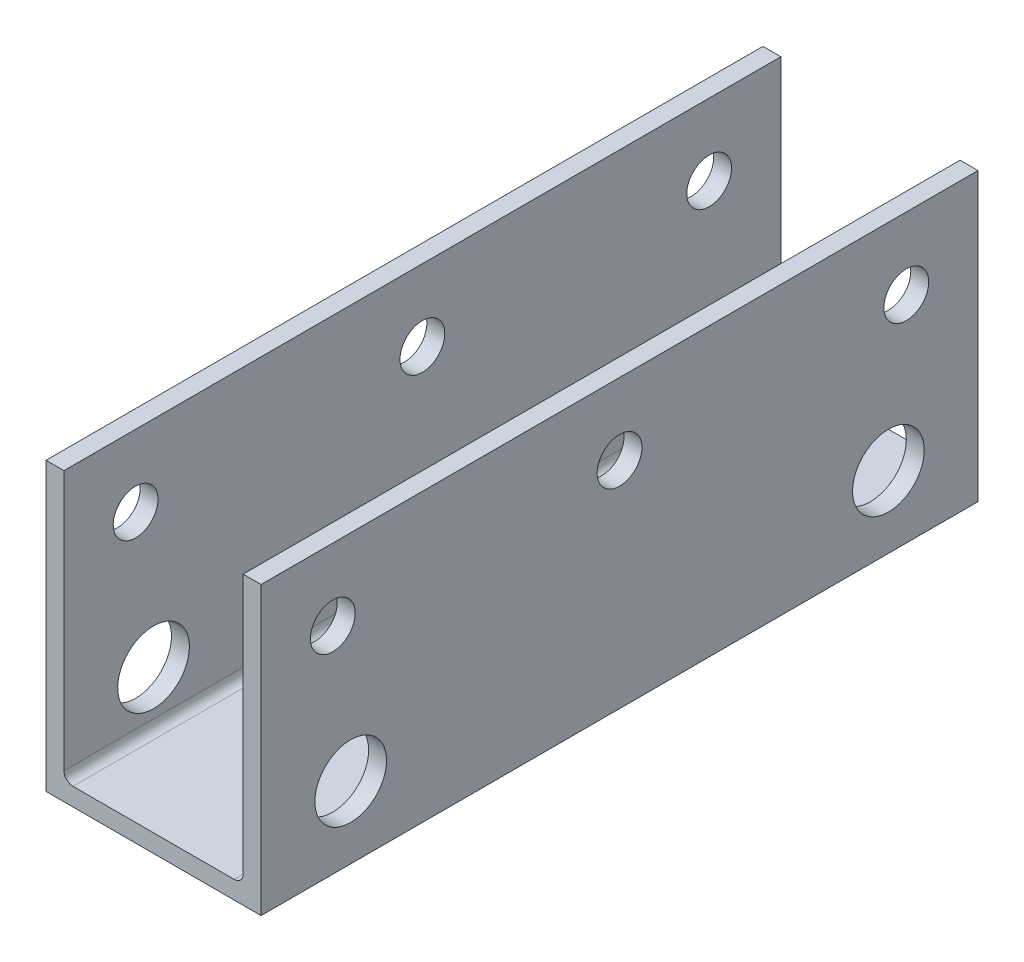
ISO-10303-21;
HEADER;
FILE_DESCRIPTION(('STEP AP214'),'2;1');
FILE_NAME('part.step','',(''),(''),'','','');
FILE_SCHEMA(('AUTOMOTIVE_DESIGN { 1 0 10303 214 1 1 1 1 }'));
ENDSEC;
DATA;
#1=APPLICATION_CONTEXT('core data for automotive mechanical design processes');
#2=APPLICATION_PROTOCOL_DEFINITION('international standard','automotive_design',2000,#1);
#3=PRODUCT_CONTEXT('',#1,'mechanical');
#4=PRODUCT('Part','Part','',(#3));
#5=PRODUCT_RELATED_PRODUCT_CATEGORY('part','',(#4));
#6=PRODUCT_DEFINITION_FORMATION('','',#4);
#7=PRODUCT_DEFINITION_CONTEXT('part definition',#1,'design');
#8=PRODUCT_DEFINITION('design','',#6,#7);
#9=PRODUCT_DEFINITION_SHAPE('','',#8);
#10=(LENGTH_UNIT() NAMED_UNIT(*) SI_UNIT(.MILLI.,.METRE.));
#11=(NAMED_UNIT(*) PLANE_ANGLE_UNIT() SI_UNIT($,.RADIAN.));
#12=(NAMED_UNIT(*) SI_UNIT($,.STERADIAN.) SOLID_ANGLE_UNIT());
#13=UNCERTAINTY_MEASURE_WITH_UNIT(LENGTH_MEASURE(1.E-05),#10,'distance_accuracy_value','');
#14=(GEOMETRIC_REPRESENTATION_CONTEXT(3) GLOBAL_UNCERTAINTY_ASSIGNED_CONTEXT((#13)) GLOBAL_UNIT_ASSIGNED_CONTEXT((#10,
#11,#12)) REPRESENTATION_CONTEXT('',''));
#15=CARTESIAN_POINT('',(0.,0.,0.));
#16=DIRECTION('',(0.,0.,1.));
#17=DIRECTION('',(1.,0.,0.));
#18=AXIS2_PLACEMENT_3D('',#15,#16,#17);
#19=CARTESIAN_POINT('',(0.,0.,127.));
#20=DIRECTION('',(1.,0.,0.));
#21=DIRECTION('',(0.,0.,-1.));
#22=AXIS2_PLACEMENT_3D('',#19,#20,#21);
#23=PLANE('',#22);
#24=CARTESIAN_POINT('',(0.,38.1,12.7));
#25=DIRECTION('',(1.,0.,0.));
#26=DIRECTION('',(0.,0.,-1.));
#27=AXIS2_PLACEMENT_3D('',#24,#25,#26);
#28=CIRCLE('',#27,3.96875);
#29=CARTESIAN_POINT('',(0.,38.1,8.73125));
#30=VERTEX_POINT('',#29);
#31=EDGE_CURVE('E235',#30,#30,#28,.T.);
#32=ORIENTED_EDGE('',*,*,#31,.T.);
#33=EDGE_LOOP('',(#32));
#34=FACE_BOUND('',#33,.T.);
#35=CARTESIAN_POINT('',(0.,38.1,63.5));
#36=DIRECTION('',(1.,0.,0.));
#37=DIRECTION('',(0.,0.,-1.));
#38=AXIS2_PLACEMENT_3D('',#35,#36,#37);
#39=CIRCLE('',#38,3.96875000000001);
#40=CARTESIAN_POINT('',(0.,38.1,59.53125));
#41=VERTEX_POINT('',#40);
#42=EDGE_CURVE('E171',#41,#41,#39,.T.);
#43=ORIENTED_EDGE('',*,*,#42,.T.);
#44=EDGE_LOOP('',(#43));
#45=FACE_BOUND('',#44,.T.);
#46=CARTESIAN_POINT('',(0.,38.1,114.3));
#47=DIRECTION('',(1.,0.,0.));
#48=DIRECTION('',(0.,0.,-1.));
#49=AXIS2_PLACEMENT_3D('',#46,#47,#48);
#50=CIRCLE('',#49,3.96874999999999);
#51=CARTESIAN_POINT('',(0.,38.1,110.33125));
#52=VERTEX_POINT('',#51);
#53=EDGE_CURVE('E167',#52,#52,#50,.T.);
#54=ORIENTED_EDGE('',*,*,#53,.T.);
#55=EDGE_LOOP('',(#54));
#56=FACE_BOUND('',#55,.T.);
#57=CARTESIAN_POINT('',(0.,12.7,111.125));
#58=DIRECTION('',(1.,0.,0.));
#59=DIRECTION('',(0.,0.,-1.));
#60=AXIS2_PLACEMENT_3D('',#57,#58,#59);
#61=CIRCLE('',#60,6.35);
#62=CARTESIAN_POINT('',(0.,12.7,104.775));
#63=VERTEX_POINT('',#62);
#64=EDGE_CURVE('E162',#63,#63,#61,.T.);
#65=ORIENTED_EDGE('',*,*,#64,.T.);
#66=EDGE_LOOP('',(#65));
#67=FACE_BOUND('',#66,.T.);
#68=CARTESIAN_POINT('',(0.,12.7,15.875));
#69=DIRECTION('',(1.,0.,0.));
#70=DIRECTION('',(0.,0.,-1.));
#71=AXIS2_PLACEMENT_3D('',#68,#69,#70);
#72=CIRCLE('',#71,6.35);
#73=CARTESIAN_POINT('',(0.,12.7,9.525));
#74=VERTEX_POINT('',#73);
#75=EDGE_CURVE('E157',#74,#74,#72,.T.);
#76=ORIENTED_EDGE('',*,*,#75,.T.);
#77=EDGE_LOOP('',(#76));
#78=FACE_BOUND('',#77,.T.);
#79=DIRECTION('',(0.,-1.,0.));
#80=VECTOR('',#79,1.);
#81=CARTESIAN_POINT('',(0.,0.,0.));
#82=LINE('',#81,#80);
#83=CARTESIAN_POINT('',(0.,50.8,0.));
#84=VERTEX_POINT('',#83);
#85=CARTESIAN_POINT('',(0.,0.,0.));
#86=VERTEX_POINT('',#85);
#87=EDGE_CURVE('E138',#84,#86,#82,.T.);
#88=ORIENTED_EDGE('',*,*,#87,.T.);
#89=DIRECTION('',(0.,0.,-1.));
#90=VECTOR('',#89,1.);
#91=CARTESIAN_POINT('',(0.,0.,127.));
#92=LINE('',#91,#90);
#93=CARTESIAN_POINT('',(0.,0.,127.));
#94=VERTEX_POINT('',#93);
#95=EDGE_CURVE('E119',#94,#86,#92,.T.);
#96=ORIENTED_EDGE('',*,*,#95,.F.);
#97=DIRECTION('',(0.,-1.,0.));
#98=VECTOR('',#97,1.);
#99=CARTESIAN_POINT('',(0.,0.,127.));
#100=LINE('',#99,#98);
#101=CARTESIAN_POINT('',(0.,50.8,127.));
#102=VERTEX_POINT('',#101);
#103=EDGE_CURVE('E126',#102,#94,#100,.T.);
#104=ORIENTED_EDGE('',*,*,#103,.F.);
#105=DIRECTION('',(0.,0.,-1.));
#106=VECTOR('',#105,1.);
#107=CARTESIAN_POINT('',(0.,50.8,127.));
#108=LINE('',#107,#106);
#109=EDGE_CURVE('E214',#102,#84,#108,.T.);
#110=ORIENTED_EDGE('',*,*,#109,.T.);
#111=EDGE_LOOP('',(#88,#96,#104,#110));
#112=FACE_BOUND('',#111,.T.);
#113=ADVANCED_FACE('F38',(#34,#45,#56,#67,#78,#112),#23,.F.);
#114=CARTESIAN_POINT('',(0.,0.,127.));
#115=DIRECTION('',(0.,1.,0.));
#116=DIRECTION('',(0.,0.,1.));
#117=AXIS2_PLACEMENT_3D('',#114,#115,#116);
#118=PLANE('',#117);
#119=DIRECTION('',(1.,0.,0.));
#120=VECTOR('',#119,1.);
#121=CARTESIAN_POINT('',(0.,0.,0.));
#122=LINE('',#121,#120);
#123=CARTESIAN_POINT('',(38.1,0.,0.));
#124=VERTEX_POINT('',#123);
#125=EDGE_CURVE('E230',#86,#124,#122,.T.);
#126=ORIENTED_EDGE('',*,*,#125,.T.);
#127=DIRECTION('',(0.,0.,-1.));
#128=VECTOR('',#127,1.);
#129=CARTESIAN_POINT('',(38.1,0.,127.));
#130=LINE('',#129,#128);
#131=CARTESIAN_POINT('',(38.1,0.,127.));
#132=VERTEX_POINT('',#131);
#133=EDGE_CURVE('E122',#132,#124,#130,.T.);
#134=ORIENTED_EDGE('',*,*,#133,.F.);
#135=DIRECTION('',(1.,0.,0.));
#136=VECTOR('',#135,1.);
#137=CARTESIAN_POINT('',(0.,0.,127.));
#138=LINE('',#137,#136);
#139=EDGE_CURVE('E115',#94,#132,#138,.T.);
#140=ORIENTED_EDGE('',*,*,#139,.F.);
#141=ORIENTED_EDGE('',*,*,#95,.T.);
#142=EDGE_LOOP('',(#126,#134,#140,#141));
#143=FACE_BOUND('',#142,.T.);
#144=ADVANCED_FACE('F117',(#143),#118,.F.);
#145=CARTESIAN_POINT('',(38.1,0.,127.));
#146=DIRECTION('',(-1.,0.,0.));
#147=DIRECTION('',(0.,0.,1.));
#148=AXIS2_PLACEMENT_3D('',#145,#146,#147);
#149=PLANE('',#148);
#150=CARTESIAN_POINT('',(38.1,38.1,12.7));
#151=DIRECTION('',(1.,0.,0.));
#152=DIRECTION('',(0.,0.,-1.));
#153=AXIS2_PLACEMENT_3D('',#150,#151,#152);
#154=CIRCLE('',#153,3.96875);
#155=CARTESIAN_POINT('',(38.1,38.1,8.73125));
#156=VERTEX_POINT('',#155);
#157=EDGE_CURVE('E265',#156,#156,#154,.T.);
#158=ORIENTED_EDGE('',*,*,#157,.F.);
#159=EDGE_LOOP('',(#158));
#160=FACE_BOUND('',#159,.T.);
#161=CARTESIAN_POINT('',(38.1,38.1,63.5));
#162=DIRECTION('',(1.,0.,0.));
#163=DIRECTION('',(0.,0.,-1.));
#164=AXIS2_PLACEMENT_3D('',#161,#162,#163);
#165=CIRCLE('',#164,3.96875000000001);
#166=CARTESIAN_POINT('',(38.1,38.1,59.53125));
#167=VERTEX_POINT('',#166);
#168=EDGE_CURVE('E268',#167,#167,#165,.T.);
#169=ORIENTED_EDGE('',*,*,#168,.F.);
#170=EDGE_LOOP('',(#169));
#171=FACE_BOUND('',#170,.T.);
#172=CARTESIAN_POINT('',(38.1,38.1,114.3));
#173=DIRECTION('',(1.,0.,0.));
#174=DIRECTION('',(0.,0.,-1.));
#175=AXIS2_PLACEMENT_3D('',#172,#173,#174);
#176=CIRCLE('',#175,3.96874999999999);
#177=CARTESIAN_POINT('',(38.1,38.1,110.33125));
#178=VERTEX_POINT('',#177);
#179=EDGE_CURVE('E271',#178,#178,#176,.T.);
#180=ORIENTED_EDGE('',*,*,#179,.F.);
#181=EDGE_LOOP('',(#180));
#182=FACE_BOUND('',#181,.T.);
#183=CARTESIAN_POINT('',(38.1,12.7,111.125));
#184=DIRECTION('',(1.,0.,0.));
#185=DIRECTION('',(0.,0.,-1.));
#186=AXIS2_PLACEMENT_3D('',#183,#184,#185);
#187=CIRCLE('',#186,6.35);
#188=CARTESIAN_POINT('',(38.1,12.7,104.775));
#189=VERTEX_POINT('',#188);
#190=EDGE_CURVE('E264',#189,#189,#187,.T.);
#191=ORIENTED_EDGE('',*,*,#190,.F.);
#192=EDGE_LOOP('',(#191));
#193=FACE_BOUND('',#192,.T.);
#194=CARTESIAN_POINT('',(38.1,12.7,15.875));
#195=DIRECTION('',(1.,0.,0.));
#196=DIRECTION('',(0.,0.,-1.));
#197=AXIS2_PLACEMENT_3D('',#194,#195,#196);
#198=CIRCLE('',#197,6.35);
#199=CARTESIAN_POINT('',(38.1,12.7,9.525));
#200=VERTEX_POINT('',#199);
#201=EDGE_CURVE('E152',#200,#200,#198,.T.);
#202=ORIENTED_EDGE('',*,*,#201,.F.);
#203=EDGE_LOOP('',(#202));
#204=FACE_BOUND('',#203,.T.);
#205=DIRECTION('',(0.,1.,0.));
#206=VECTOR('',#205,1.);
#207=CARTESIAN_POINT('',(38.1,0.,0.));
#208=LINE('',#207,#206);
#209=CARTESIAN_POINT('',(38.1,50.8,0.));
#210=VERTEX_POINT('',#209);
#211=EDGE_CURVE('E229',#124,#210,#208,.T.);
#212=ORIENTED_EDGE('',*,*,#211,.T.);
#213=DIRECTION('',(0.,0.,-1.));
#214=VECTOR('',#213,1.);
#215=CARTESIAN_POINT('',(38.1,50.8,127.));
#216=LINE('',#215,#214);
#217=CARTESIAN_POINT('',(38.1,50.8,127.));
#218=VERTEX_POINT('',#217);
#219=EDGE_CURVE('E144',#218,#210,#216,.T.);
#220=ORIENTED_EDGE('',*,*,#219,.F.);
#221=DIRECTION('',(0.,1.,0.));
#222=VECTOR('',#221,1.);
#223=CARTESIAN_POINT('',(38.1,0.,127.));
#224=LINE('',#223,#222);
#225=EDGE_CURVE('E125',#132,#218,#224,.T.);
#226=ORIENTED_EDGE('',*,*,#225,.F.);
#227=ORIENTED_EDGE('',*,*,#133,.T.);
#228=EDGE_LOOP('',(#212,#220,#226,#227));
#229=FACE_BOUND('',#228,.T.);
#230=ADVANCED_FACE('F280',(#160,#171,#182,#193,#204,#229),#149,.F.);
#231=CARTESIAN_POINT('',(34.925,50.8,127.));
#232=DIRECTION('',(0.,-1.,0.));
#233=DIRECTION('',(0.,0.,-1.));
#234=AXIS2_PLACEMENT_3D('',#231,#232,#233);
#235=PLANE('',#234);
#236=DIRECTION('',(-1.,0.,0.));
#237=VECTOR('',#236,1.);
#238=CARTESIAN_POINT('',(34.925,50.8,0.));
#239=LINE('',#238,#237);
#240=CARTESIAN_POINT('',(34.925,50.8,0.));
#241=VERTEX_POINT('',#240);
#242=EDGE_CURVE('E209',#210,#241,#239,.T.);
#243=ORIENTED_EDGE('',*,*,#242,.T.);
#244=DIRECTION('',(0.,0.,-1.));
#245=VECTOR('',#244,1.);
#246=CARTESIAN_POINT('',(34.925,50.8,127.));
#247=LINE('',#246,#245);
#248=CARTESIAN_POINT('',(34.925,50.8,127.));
#249=VERTEX_POINT('',#248);
#250=EDGE_CURVE('E217',#249,#241,#247,.T.);
#251=ORIENTED_EDGE('',*,*,#250,.F.);
#252=DIRECTION('',(-1.,0.,0.));
#253=VECTOR('',#252,1.);
#254=CARTESIAN_POINT('',(34.925,50.8,127.));
#255=LINE('',#254,#253);
#256=EDGE_CURVE('E226',#218,#249,#255,.T.);
#257=ORIENTED_EDGE('',*,*,#256,.F.);
#258=ORIENTED_EDGE('',*,*,#219,.T.);
#259=EDGE_LOOP('',(#243,#251,#257,#258));
#260=FACE_BOUND('',#259,.T.);
#261=ADVANCED_FACE('F224',(#260),#235,.F.);
#262=CARTESIAN_POINT('',(34.925,3.175,127.));
#263=DIRECTION('',(1.,0.,0.));
#264=DIRECTION('',(0.,0.,-1.));
#265=AXIS2_PLACEMENT_3D('',#262,#263,#264);
#266=PLANE('',#265);
#267=CARTESIAN_POINT('',(34.925,38.1,12.7));
#268=DIRECTION('',(1.,0.,0.));
#269=DIRECTION('',(0.,0.,-1.));
#270=AXIS2_PLACEMENT_3D('',#267,#268,#269);
#271=CIRCLE('',#270,3.96875);
#272=CARTESIAN_POINT('',(34.925,38.1,8.73125));
#273=VERTEX_POINT('',#272);
#274=EDGE_CURVE('E170',#273,#273,#271,.T.);
#275=ORIENTED_EDGE('',*,*,#274,.T.);
#276=EDGE_LOOP('',(#275));
#277=FACE_BOUND('',#276,.T.);
#278=CARTESIAN_POINT('',(34.925,38.1,63.5));
#279=DIRECTION('',(1.,0.,0.));
#280=DIRECTION('',(0.,0.,-1.));
#281=AXIS2_PLACEMENT_3D('',#278,#279,#280);
#282=CIRCLE('',#281,3.96875000000001);
#283=CARTESIAN_POINT('',(34.925,38.1,59.53125));
#284=VERTEX_POINT('',#283);
#285=EDGE_CURVE('E166',#284,#284,#282,.T.);
#286=ORIENTED_EDGE('',*,*,#285,.T.);
#287=EDGE_LOOP('',(#286));
#288=FACE_BOUND('',#287,.T.);
#289=CARTESIAN_POINT('',(34.925,38.1,114.3));
#290=DIRECTION('',(1.,0.,0.));
#291=DIRECTION('',(0.,0.,-1.));
#292=AXIS2_PLACEMENT_3D('',#289,#290,#291);
#293=CIRCLE('',#292,3.96874999999999);
#294=CARTESIAN_POINT('',(34.925,38.1,110.33125));
#295=VERTEX_POINT('',#294);
#296=EDGE_CURVE('E161',#295,#295,#293,.T.);
#297=ORIENTED_EDGE('',*,*,#296,.T.);
#298=EDGE_LOOP('',(#297));
#299=FACE_BOUND('',#298,.T.);
#300=CARTESIAN_POINT('',(34.925,12.7,111.125));
#301=DIRECTION('',(1.,0.,0.));
#302=DIRECTION('',(0.,0.,-1.));
#303=AXIS2_PLACEMENT_3D('',#300,#301,#302);
#304=CIRCLE('',#303,6.35);
#305=CARTESIAN_POINT('',(34.925,12.7,104.775));
#306=VERTEX_POINT('',#305);
#307=EDGE_CURVE('E156',#306,#306,#304,.T.);
#308=ORIENTED_EDGE('',*,*,#307,.T.);
#309=EDGE_LOOP('',(#308));
#310=FACE_BOUND('',#309,.T.);
#311=CARTESIAN_POINT('',(34.925,12.7,15.875));
#312=DIRECTION('',(1.,0.,0.));
#313=DIRECTION('',(0.,0.,-1.));
#314=AXIS2_PLACEMENT_3D('',#311,#312,#313);
#315=CIRCLE('',#314,6.35);
#316=CARTESIAN_POINT('',(34.925,12.7,9.525));
#317=VERTEX_POINT('',#316);
#318=EDGE_CURVE('E151',#317,#317,#315,.T.);
#319=ORIENTED_EDGE('',*,*,#318,.T.);
#320=EDGE_LOOP('',(#319));
#321=FACE_BOUND('',#320,.T.);
#322=DIRECTION('',(0.,-1.,0.));
#323=VECTOR('',#322,1.);
#324=CARTESIAN_POINT('',(34.925,3.175,0.));
#325=LINE('',#324,#323);
#326=CARTESIAN_POINT('',(34.925,4.7752,0.));
#327=VERTEX_POINT('',#326);
#328=EDGE_CURVE('E206',#241,#327,#325,.T.);
#329=ORIENTED_EDGE('',*,*,#328,.T.);
#330=DIRECTION('',(0.,0.,-1.));
#331=VECTOR('',#330,1.);
#332=CARTESIAN_POINT('',(34.925,4.7752,127.));
#333=LINE('',#332,#331);
#334=CARTESIAN_POINT('',(34.925,4.7752,127.));
#335=VERTEX_POINT('',#334);
#336=EDGE_CURVE('E53',#327,#335,#333,.F.);
#337=ORIENTED_EDGE('',*,*,#336,.T.);
#338=DIRECTION('',(0.,-1.,0.));
#339=VECTOR('',#338,1.);
#340=CARTESIAN_POINT('',(34.925,3.175,127.));
#341=LINE('',#340,#339);
#342=EDGE_CURVE('E238',#249,#335,#341,.T.);
#343=ORIENTED_EDGE('',*,*,#342,.F.);
#344=ORIENTED_EDGE('',*,*,#250,.T.);
#345=EDGE_LOOP('',(#329,#337,#343,#344));
#346=FACE_BOUND('',#345,.T.);
#347=ADVANCED_FACE('F287',(#277,#288,#299,#310,#321,#346),#266,.F.);
#348=CARTESIAN_POINT('',(3.175,3.175,127.));
#349=DIRECTION('',(0.,-1.,0.));
#350=DIRECTION('',(0.,0.,-1.));
#351=AXIS2_PLACEMENT_3D('',#348,#349,#350);
#352=PLANE('',#351);
#353=DIRECTION('',(-1.,0.,0.));
#354=VECTOR('',#353,1.);
#355=CARTESIAN_POINT('',(3.175,3.175,0.));
#356=LINE('',#355,#354);
#357=CARTESIAN_POINT('',(33.3248,3.175,0.));
#358=VERTEX_POINT('',#357);
#359=CARTESIAN_POINT('',(4.7752,3.175,0.));
#360=VERTEX_POINT('',#359);
#361=EDGE_CURVE('E200',#358,#360,#356,.T.);
#362=ORIENTED_EDGE('',*,*,#361,.T.);
#363=DIRECTION('',(0.,0.,-1.));
#364=VECTOR('',#363,1.);
#365=CARTESIAN_POINT('',(4.7752,3.175,127.));
#366=LINE('',#365,#364);
#367=CARTESIAN_POINT('',(4.7752,3.175,127.));
#368=VERTEX_POINT('',#367);
#369=EDGE_CURVE('E175',#360,#368,#366,.F.);
#370=ORIENTED_EDGE('',*,*,#369,.T.);
#371=DIRECTION('',(-1.,0.,0.));
#372=VECTOR('',#371,1.);
#373=CARTESIAN_POINT('',(3.175,3.175,127.));
#374=LINE('',#373,#372);
#375=CARTESIAN_POINT('',(33.3248,3.175,127.));
#376=VERTEX_POINT('',#375);
#377=EDGE_CURVE('E187',#376,#368,#374,.T.);
#378=ORIENTED_EDGE('',*,*,#377,.F.);
#379=DIRECTION('',(0.,0.,-1.));
#380=VECTOR('',#379,1.);
#381=CARTESIAN_POINT('',(33.3248,3.175,0.));
#382=LINE('',#381,#380);
#383=EDGE_CURVE('E142',#376,#358,#382,.T.);
#384=ORIENTED_EDGE('',*,*,#383,.T.);
#385=EDGE_LOOP('',(#362,#370,#378,#384));
#386=FACE_BOUND('',#385,.T.);
#387=ADVANCED_FACE('F204',(#386),#352,.F.);
#388=CARTESIAN_POINT('',(3.175,50.8,127.));
#389=DIRECTION('',(-1.,0.,0.));
#390=DIRECTION('',(0.,-1.,0.));
#391=AXIS2_PLACEMENT_3D('',#388,#389,#390);
#392=PLANE('',#391);
#393=CARTESIAN_POINT('',(3.175,38.1,12.7));
#394=DIRECTION('',(-1.,0.,0.));
#395=DIRECTION('',(0.,-1.,0.));
#396=AXIS2_PLACEMENT_3D('',#393,#394,#395);
#397=CIRCLE('',#396,3.96875);
#398=CARTESIAN_POINT('',(3.175,34.13125,12.7));
#399=VERTEX_POINT('',#398);
#400=EDGE_CURVE('E168',#399,#399,#397,.T.);
#401=ORIENTED_EDGE('',*,*,#400,.T.);
#402=EDGE_LOOP('',(#401));
#403=FACE_BOUND('',#402,.T.);
#404=CARTESIAN_POINT('',(3.175,38.1,63.5));
#405=DIRECTION('',(-1.,0.,0.));
#406=DIRECTION('',(0.,-1.,0.));
#407=AXIS2_PLACEMENT_3D('',#404,#405,#406);
#408=CIRCLE('',#407,3.96875000000001);
#409=CARTESIAN_POINT('',(3.175,34.13125,63.5));
#410=VERTEX_POINT('',#409);
#411=EDGE_CURVE('E163',#410,#410,#408,.T.);
#412=ORIENTED_EDGE('',*,*,#411,.T.);
#413=EDGE_LOOP('',(#412));
#414=FACE_BOUND('',#413,.T.);
#415=CARTESIAN_POINT('',(3.175,38.1,114.3));
#416=DIRECTION('',(-1.,0.,0.));
#417=DIRECTION('',(0.,-1.,0.));
#418=AXIS2_PLACEMENT_3D('',#415,#416,#417);
#419=CIRCLE('',#418,3.96874999999999);
#420=CARTESIAN_POINT('',(3.175,34.13125,114.3));
#421=VERTEX_POINT('',#420);
#422=EDGE_CURVE('E158',#421,#421,#419,.T.);
#423=ORIENTED_EDGE('',*,*,#422,.T.);
#424=EDGE_LOOP('',(#423));
#425=FACE_BOUND('',#424,.T.);
#426=CARTESIAN_POINT('',(3.175,12.7,111.125));
#427=DIRECTION('',(-1.,0.,0.));
#428=DIRECTION('',(0.,-1.,0.));
#429=AXIS2_PLACEMENT_3D('',#426,#427,#428);
#430=CIRCLE('',#429,6.35);
#431=CARTESIAN_POINT('',(3.175,6.35,111.125));
#432=VERTEX_POINT('',#431);
#433=EDGE_CURVE('E153',#432,#432,#430,.T.);
#434=ORIENTED_EDGE('',*,*,#433,.T.);
#435=EDGE_LOOP('',(#434));
#436=FACE_BOUND('',#435,.T.);
#437=CARTESIAN_POINT('',(3.175,12.7,15.875));
#438=DIRECTION('',(-1.,0.,0.));
#439=DIRECTION('',(0.,-1.,0.));
#440=AXIS2_PLACEMENT_3D('',#437,#438,#439);
#441=CIRCLE('',#440,6.35);
#442=CARTESIAN_POINT('',(3.175,6.35,15.875));
#443=VERTEX_POINT('',#442);
#444=EDGE_CURVE('E148',#443,#443,#441,.T.);
#445=ORIENTED_EDGE('',*,*,#444,.T.);
#446=EDGE_LOOP('',(#445));
#447=FACE_BOUND('',#446,.T.);
#448=DIRECTION('',(0.,1.,0.));
#449=VECTOR('',#448,1.);
#450=CARTESIAN_POINT('',(3.175,50.8,127.));
#451=LINE('',#450,#449);
#452=CARTESIAN_POINT('',(3.175,4.7752,127.));
#453=VERTEX_POINT('',#452);
#454=CARTESIAN_POINT('',(3.175,50.8,127.));
#455=VERTEX_POINT('',#454);
#456=EDGE_CURVE('E184',#453,#455,#451,.T.);
#457=ORIENTED_EDGE('',*,*,#456,.F.);
#458=DIRECTION('',(0.,0.,-1.));
#459=VECTOR('',#458,1.);
#460=CARTESIAN_POINT('',(3.175,4.7752,0.));
#461=LINE('',#460,#459);
#462=CARTESIAN_POINT('',(3.175,4.7752,0.));
#463=VERTEX_POINT('',#462);
#464=EDGE_CURVE('E139',#453,#463,#461,.T.);
#465=ORIENTED_EDGE('',*,*,#464,.T.);
#466=DIRECTION('',(0.,1.,0.));
#467=VECTOR('',#466,1.);
#468=CARTESIAN_POINT('',(3.175,50.8,0.));
#469=LINE('',#468,#467);
#470=CARTESIAN_POINT('',(3.175,50.8,0.));
#471=VERTEX_POINT('',#470);
#472=EDGE_CURVE('E202',#463,#471,#469,.T.);
#473=ORIENTED_EDGE('',*,*,#472,.T.);
#474=DIRECTION('',(0.,0.,-1.));
#475=VECTOR('',#474,1.);
#476=CARTESIAN_POINT('',(3.175,50.8,127.));
#477=LINE('',#476,#475);
#478=EDGE_CURVE('E195',#455,#471,#477,.T.);
#479=ORIENTED_EDGE('',*,*,#478,.F.);
#480=EDGE_LOOP('',(#457,#465,#473,#479));
#481=FACE_BOUND('',#480,.T.);
#482=ADVANCED_FACE('F192',(#403,#414,#425,#436,#447,#481),#392,.F.);
#483=CARTESIAN_POINT('',(0.,50.8,127.));
#484=DIRECTION('',(0.,-1.,0.));
#485=DIRECTION('',(0.,0.,-1.));
#486=AXIS2_PLACEMENT_3D('',#483,#484,#485);
#487=PLANE('',#486);
#488=DIRECTION('',(-1.,0.,0.));
#489=VECTOR('',#488,1.);
#490=CARTESIAN_POINT('',(0.,50.8,0.));
#491=LINE('',#490,#489);
#492=EDGE_CURVE('E135',#471,#84,#491,.T.);
#493=ORIENTED_EDGE('',*,*,#492,.T.);
#494=ORIENTED_EDGE('',*,*,#109,.F.);
#495=DIRECTION('',(-1.,0.,0.));
#496=VECTOR('',#495,1.);
#497=CARTESIAN_POINT('',(0.,50.8,127.));
#498=LINE('',#497,#496);
#499=EDGE_CURVE('E131',#455,#102,#498,.T.);
#500=ORIENTED_EDGE('',*,*,#499,.F.);
#501=ORIENTED_EDGE('',*,*,#478,.T.);
#502=EDGE_LOOP('',(#493,#494,#500,#501));
#503=FACE_BOUND('',#502,.T.);
#504=ADVANCED_FACE('F343',(#503),#487,.F.);
#505=CARTESIAN_POINT('',(0.,0.,127.));
#506=DIRECTION('',(0.,0.,-1.));
#507=DIRECTION('',(-1.,0.,0.));
#508=AXIS2_PLACEMENT_3D('',#505,#506,#507);
#509=PLANE('',#508);
#510=ORIENTED_EDGE('',*,*,#103,.T.);
#511=ORIENTED_EDGE('',*,*,#139,.T.);
#512=ORIENTED_EDGE('',*,*,#225,.T.);
#513=ORIENTED_EDGE('',*,*,#256,.T.);
#514=ORIENTED_EDGE('',*,*,#342,.T.);
#515=CARTESIAN_POINT('',(33.3248,4.7752,127.));
#516=DIRECTION('',(0.,0.,-1.));
#517=DIRECTION('',(-1.,0.,0.));
#518=AXIS2_PLACEMENT_3D('',#515,#516,#517);
#519=CIRCLE('',#518,1.6002);
#520=EDGE_CURVE('E11',#335,#376,#519,.T.);
#521=ORIENTED_EDGE('',*,*,#520,.T.);
#522=ORIENTED_EDGE('',*,*,#377,.T.);
#523=CARTESIAN_POINT('',(4.7752,4.7752,127.));
#524=DIRECTION('',(0.,0.,-1.));
#525=DIRECTION('',(-1.,0.,0.));
#526=AXIS2_PLACEMENT_3D('',#523,#524,#525);
#527=CIRCLE('',#526,1.6002);
#528=EDGE_CURVE('E180',#368,#453,#527,.T.);
#529=ORIENTED_EDGE('',*,*,#528,.T.);
#530=ORIENTED_EDGE('',*,*,#456,.T.);
#531=ORIENTED_EDGE('',*,*,#499,.T.);
#532=EDGE_LOOP('',(#510,#511,#512,#513,#514,#521,#522,#529,#530,#531));
#533=FACE_BOUND('',#532,.T.);
#534=ADVANCED_FACE('F129',(#533),#509,.F.);
#535=CARTESIAN_POINT('',(0.,0.,0.));
#536=DIRECTION('',(0.,0.,-1.));
#537=DIRECTION('',(-1.,0.,0.));
#538=AXIS2_PLACEMENT_3D('',#535,#536,#537);
#539=PLANE('',#538);
#540=ORIENTED_EDGE('',*,*,#87,.F.);
#541=ORIENTED_EDGE('',*,*,#492,.F.);
#542=ORIENTED_EDGE('',*,*,#472,.F.);
#543=CARTESIAN_POINT('',(4.7752,4.7752,0.));
#544=DIRECTION('',(0.,0.,-1.));
#545=DIRECTION('',(-1.,0.,0.));
#546=AXIS2_PLACEMENT_3D('',#543,#544,#545);
#547=CIRCLE('',#546,1.6002);
#548=EDGE_CURVE('E178',#463,#360,#547,.F.);
#549=ORIENTED_EDGE('',*,*,#548,.T.);
#550=ORIENTED_EDGE('',*,*,#361,.F.);
#551=CARTESIAN_POINT('',(33.3248,4.7752,0.));
#552=DIRECTION('',(0.,0.,-1.));
#553=DIRECTION('',(-1.,0.,0.));
#554=AXIS2_PLACEMENT_3D('',#551,#552,#553);
#555=CIRCLE('',#554,1.6002);
#556=EDGE_CURVE('E46',#358,#327,#555,.F.);
#557=ORIENTED_EDGE('',*,*,#556,.T.);
#558=ORIENTED_EDGE('',*,*,#328,.F.);
#559=ORIENTED_EDGE('',*,*,#242,.F.);
#560=ORIENTED_EDGE('',*,*,#211,.F.);
#561=ORIENTED_EDGE('',*,*,#125,.F.);
#562=EDGE_LOOP('',(#540,#541,#542,#549,#550,#557,#558,#559,#560,#561));
#563=FACE_BOUND('',#562,.T.);
#564=ADVANCED_FACE('F199',(#563),#539,.T.);
#565=CARTESIAN_POINT('',(-114.3,12.7,15.875));
#566=DIRECTION('',(1.,0.,0.));
#567=DIRECTION('',(0.,0.,-1.));
#568=AXIS2_PLACEMENT_3D('',#565,#566,#567);
#569=CYLINDRICAL_SURFACE('',#568,6.35);
#570=ORIENTED_EDGE('',*,*,#444,.F.);
#571=EDGE_LOOP('',(#570));
#572=FACE_BOUND('',#571,.T.);
#573=ORIENTED_EDGE('',*,*,#75,.F.);
#574=EDGE_LOOP('',(#573));
#575=FACE_BOUND('',#574,.T.);
#576=ADVANCED_FACE('F334',(#572,#575),#569,.F.);
#577=CARTESIAN_POINT('',(-114.3,12.7,111.125));
#578=DIRECTION('',(1.,0.,0.));
#579=DIRECTION('',(0.,0.,-1.));
#580=AXIS2_PLACEMENT_3D('',#577,#578,#579);
#581=CYLINDRICAL_SURFACE('',#580,6.35);
#582=ORIENTED_EDGE('',*,*,#433,.F.);
#583=EDGE_LOOP('',(#582));
#584=FACE_BOUND('',#583,.T.);
#585=ORIENTED_EDGE('',*,*,#64,.F.);
#586=EDGE_LOOP('',(#585));
#587=FACE_BOUND('',#586,.T.);
#588=ADVANCED_FACE('F355',(#584,#587),#581,.F.);
#589=CARTESIAN_POINT('',(-114.3,38.1,114.3));
#590=DIRECTION('',(1.,0.,0.));
#591=DIRECTION('',(0.,0.,-1.));
#592=AXIS2_PLACEMENT_3D('',#589,#590,#591);
#593=CYLINDRICAL_SURFACE('',#592,3.96874999999999);
#594=ORIENTED_EDGE('',*,*,#422,.F.);
#595=EDGE_LOOP('',(#594));
#596=FACE_BOUND('',#595,.T.);
#597=ORIENTED_EDGE('',*,*,#53,.F.);
#598=EDGE_LOOP('',(#597));
#599=FACE_BOUND('',#598,.T.);
#600=ADVANCED_FACE('F335',(#596,#599),#593,.F.);
#601=CARTESIAN_POINT('',(-114.3,38.1,63.5));
#602=DIRECTION('',(1.,0.,0.));
#603=DIRECTION('',(0.,0.,-1.));
#604=AXIS2_PLACEMENT_3D('',#601,#602,#603);
#605=CYLINDRICAL_SURFACE('',#604,3.96875000000001);
#606=ORIENTED_EDGE('',*,*,#411,.F.);
#607=EDGE_LOOP('',(#606));
#608=FACE_BOUND('',#607,.T.);
#609=ORIENTED_EDGE('',*,*,#42,.F.);
#610=EDGE_LOOP('',(#609));
#611=FACE_BOUND('',#610,.T.);
#612=ADVANCED_FACE('F323',(#608,#611),#605,.F.);
#613=CARTESIAN_POINT('',(-114.3,38.1,12.7));
#614=DIRECTION('',(1.,0.,0.));
#615=DIRECTION('',(0.,0.,-1.));
#616=AXIS2_PLACEMENT_3D('',#613,#614,#615);
#617=CYLINDRICAL_SURFACE('',#616,3.96875);
#618=ORIENTED_EDGE('',*,*,#400,.F.);
#619=EDGE_LOOP('',(#618));
#620=FACE_BOUND('',#619,.T.);
#621=ORIENTED_EDGE('',*,*,#31,.F.);
#622=EDGE_LOOP('',(#621));
#623=FACE_BOUND('',#622,.T.);
#624=ADVANCED_FACE('F316',(#620,#623),#617,.F.);
#625=ORIENTED_EDGE('',*,*,#201,.T.);
#626=EDGE_LOOP('',(#625));
#627=FACE_BOUND('',#626,.T.);
#628=ORIENTED_EDGE('',*,*,#318,.F.);
#629=EDGE_LOOP('',(#628));
#630=FACE_BOUND('',#629,.T.);
#631=ADVANCED_FACE('F327',(#627,#630),#569,.F.);
#632=ORIENTED_EDGE('',*,*,#190,.T.);
#633=EDGE_LOOP('',(#632));
#634=FACE_BOUND('',#633,.T.);
#635=ORIENTED_EDGE('',*,*,#307,.F.);
#636=EDGE_LOOP('',(#635));
#637=FACE_BOUND('',#636,.T.);
#638=ADVANCED_FACE('F277',(#634,#637),#581,.F.);
#639=ORIENTED_EDGE('',*,*,#179,.T.);
#640=EDGE_LOOP('',(#639));
#641=FACE_BOUND('',#640,.T.);
#642=ORIENTED_EDGE('',*,*,#296,.F.);
#643=EDGE_LOOP('',(#642));
#644=FACE_BOUND('',#643,.T.);
#645=ADVANCED_FACE('F320',(#641,#644),#593,.F.);
#646=ORIENTED_EDGE('',*,*,#168,.T.);
#647=EDGE_LOOP('',(#646));
#648=FACE_BOUND('',#647,.T.);
#649=ORIENTED_EDGE('',*,*,#285,.F.);
#650=EDGE_LOOP('',(#649));
#651=FACE_BOUND('',#650,.T.);
#652=ADVANCED_FACE('F313',(#648,#651),#605,.F.);
#653=ORIENTED_EDGE('',*,*,#157,.T.);
#654=EDGE_LOOP('',(#653));
#655=FACE_BOUND('',#654,.T.);
#656=ORIENTED_EDGE('',*,*,#274,.F.);
#657=EDGE_LOOP('',(#656));
#658=FACE_BOUND('',#657,.T.);
#659=ADVANCED_FACE('F307',(#655,#658),#617,.F.);
#660=CARTESIAN_POINT('',(4.7752,4.7752,127.));
#661=DIRECTION('',(0.,0.,1.));
#662=DIRECTION('',(1.,0.,0.));
#663=AXIS2_PLACEMENT_3D('',#660,#661,#662);
#664=CYLINDRICAL_SURFACE('',#663,1.6002);
#665=ORIENTED_EDGE('',*,*,#528,.F.);
#666=ORIENTED_EDGE('',*,*,#369,.F.);
#667=ORIENTED_EDGE('',*,*,#548,.F.);
#668=ORIENTED_EDGE('',*,*,#464,.F.);
#669=EDGE_LOOP('',(#665,#666,#667,#668));
#670=FACE_BOUND('',#669,.T.);
#671=ADVANCED_FACE('F197',(#670),#664,.F.);
#672=CARTESIAN_POINT('',(33.3248,4.7752,127.));
#673=DIRECTION('',(0.,0.,1.));
#674=DIRECTION('',(1.,0.,0.));
#675=AXIS2_PLACEMENT_3D('',#672,#673,#674);
#676=CYLINDRICAL_SURFACE('',#675,1.6002);
#677=ORIENTED_EDGE('',*,*,#520,.F.);
#678=ORIENTED_EDGE('',*,*,#336,.F.);
#679=ORIENTED_EDGE('',*,*,#556,.F.);
#680=ORIENTED_EDGE('',*,*,#383,.F.);
#681=EDGE_LOOP('',(#677,#678,#679,#680));
#682=FACE_BOUND('',#681,.T.);
#683=ADVANCED_FACE('F40',(#682),#676,.F.);
#684=CLOSED_SHELL('',(#113,#144,#230,#261,#347,#387,#482,#504,#534,#564,#576,#588,#600,#612,
#624,#631,#638,#645,#652,#659,#671,#683));
#685=MANIFOLD_SOLID_BREP('B2',#684);
#686=ADVANCED_BREP_SHAPE_REPRESENTATION('',(#18,#685),#14);
#687=SHAPE_DEFINITION_REPRESENTATION(#9,#686);
ENDSEC;
END-ISO-10303-21;
